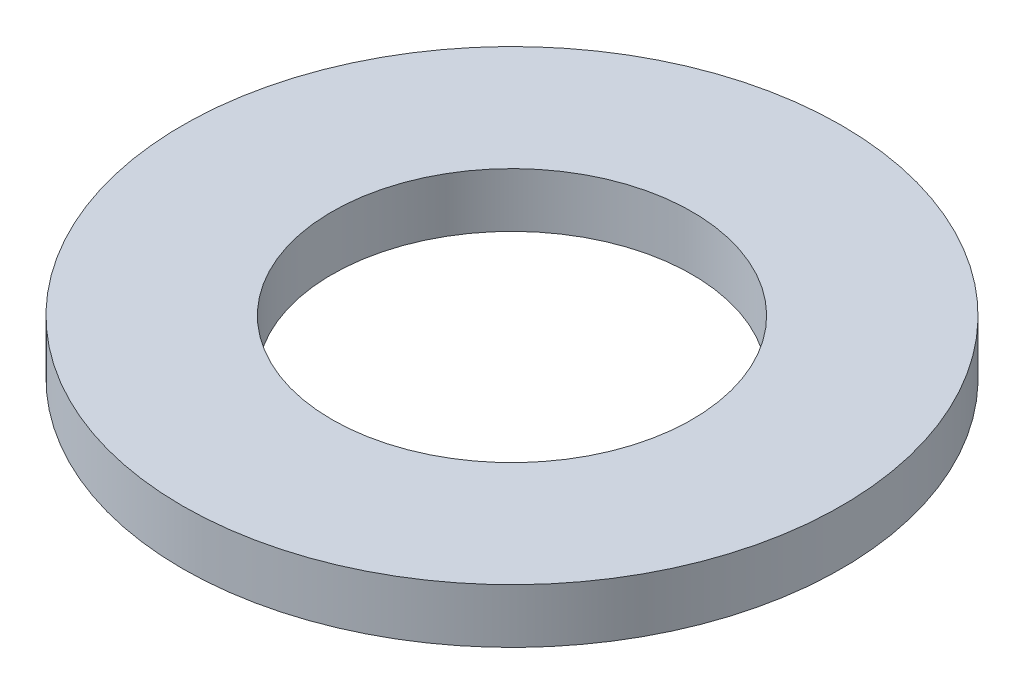
ISO-10303-21;
HEADER;
FILE_DESCRIPTION(('STEP AP214'),'2;1');
FILE_NAME('part.step','',(''),(''),'','','');
FILE_SCHEMA(('AUTOMOTIVE_DESIGN { 1 0 10303 214 1 1 1 1 }'));
ENDSEC;
DATA;
#1=APPLICATION_CONTEXT('core data for automotive mechanical design processes');
#2=APPLICATION_PROTOCOL_DEFINITION('international standard','automotive_design',2000,#1);
#3=PRODUCT_CONTEXT('',#1,'mechanical');
#4=PRODUCT('Part','Part','',(#3));
#5=PRODUCT_RELATED_PRODUCT_CATEGORY('part','',(#4));
#6=PRODUCT_DEFINITION_FORMATION('','',#4);
#7=PRODUCT_DEFINITION_CONTEXT('part definition',#1,'design');
#8=PRODUCT_DEFINITION('design','',#6,#7);
#9=PRODUCT_DEFINITION_SHAPE('','',#8);
#10=(LENGTH_UNIT() NAMED_UNIT(*) SI_UNIT(.MILLI.,.METRE.));
#11=(NAMED_UNIT(*) PLANE_ANGLE_UNIT() SI_UNIT($,.RADIAN.));
#12=(NAMED_UNIT(*) SI_UNIT($,.STERADIAN.) SOLID_ANGLE_UNIT());
#13=UNCERTAINTY_MEASURE_WITH_UNIT(LENGTH_MEASURE(1.E-05),#10,'distance_accuracy_value','');
#14=(GEOMETRIC_REPRESENTATION_CONTEXT(3) GLOBAL_UNCERTAINTY_ASSIGNED_CONTEXT((#13)) GLOBAL_UNIT_ASSIGNED_CONTEXT((#10,
#11,#12)) REPRESENTATION_CONTEXT('',''));
#15=CARTESIAN_POINT('',(0.,0.,0.));
#16=DIRECTION('',(0.,0.,1.));
#17=DIRECTION('',(1.,0.,0.));
#18=AXIS2_PLACEMENT_3D('',#15,#16,#17);
#19=CARTESIAN_POINT('',(0.,0.8,0.));
#20=DIRECTION('',(0.,1.,0.));
#21=DIRECTION('',(0.,0.,1.));
#22=AXIS2_PLACEMENT_3D('',#19,#20,#21);
#23=PLANE('',#22);
#24=CARTESIAN_POINT('',(0.,0.8,0.));
#25=DIRECTION('',(0.,1.,0.));
#26=DIRECTION('',(0.,0.,1.));
#27=AXIS2_PLACEMENT_3D('',#24,#25,#26);
#28=CIRCLE('',#27,4.85);
#29=CARTESIAN_POINT('',(0.,0.8,4.85));
#30=VERTEX_POINT('',#29);
#31=EDGE_CURVE('E10',#30,#30,#28,.T.);
#32=ORIENTED_EDGE('',*,*,#31,.T.);
#33=EDGE_LOOP('',(#32));
#34=FACE_BOUND('',#33,.T.);
#35=CARTESIAN_POINT('',(0.,0.8,0.));
#36=DIRECTION('',(0.,1.,0.));
#37=DIRECTION('',(0.,0.,1.));
#38=AXIS2_PLACEMENT_3D('',#35,#36,#37);
#39=CIRCLE('',#38,2.65);
#40=CARTESIAN_POINT('',(0.,0.8,2.65));
#41=VERTEX_POINT('',#40);
#42=EDGE_CURVE('E42',#41,#41,#39,.T.);
#43=ORIENTED_EDGE('',*,*,#42,.F.);
#44=EDGE_LOOP('',(#43));
#45=FACE_BOUND('',#44,.T.);
#46=ADVANCED_FACE('F31',(#34,#45),#23,.T.);
#47=CARTESIAN_POINT('',(0.,0.,0.));
#48=DIRECTION('',(0.,1.,0.));
#49=DIRECTION('',(0.,0.,1.));
#50=AXIS2_PLACEMENT_3D('',#47,#48,#49);
#51=PLANE('',#50);
#52=CARTESIAN_POINT('',(0.,0.,0.));
#53=DIRECTION('',(0.,1.,0.));
#54=DIRECTION('',(0.,0.,1.));
#55=AXIS2_PLACEMENT_3D('',#52,#53,#54);
#56=CIRCLE('',#55,4.85);
#57=CARTESIAN_POINT('',(0.,0.,4.85));
#58=VERTEX_POINT('',#57);
#59=EDGE_CURVE('E35',#58,#58,#56,.T.);
#60=ORIENTED_EDGE('',*,*,#59,.F.);
#61=EDGE_LOOP('',(#60));
#62=FACE_BOUND('',#61,.T.);
#63=CARTESIAN_POINT('',(0.,0.,0.));
#64=DIRECTION('',(0.,1.,0.));
#65=DIRECTION('',(0.,0.,1.));
#66=AXIS2_PLACEMENT_3D('',#63,#64,#65);
#67=CIRCLE('',#66,2.65);
#68=CARTESIAN_POINT('',(0.,0.,2.65));
#69=VERTEX_POINT('',#68);
#70=EDGE_CURVE('E44',#69,#69,#67,.T.);
#71=ORIENTED_EDGE('',*,*,#70,.T.);
#72=EDGE_LOOP('',(#71));
#73=FACE_BOUND('',#72,.T.);
#74=ADVANCED_FACE('F54',(#62,#73),#51,.F.);
#75=CARTESIAN_POINT('',(0.,0.8,0.));
#76=DIRECTION('',(0.,-1.,0.));
#77=DIRECTION('',(0.,0.,-1.));
#78=AXIS2_PLACEMENT_3D('',#75,#76,#77);
#79=CYLINDRICAL_SURFACE('',#78,4.85);
#80=ORIENTED_EDGE('',*,*,#31,.F.);
#81=EDGE_LOOP('',(#80));
#82=FACE_BOUND('',#81,.T.);
#83=ORIENTED_EDGE('',*,*,#59,.T.);
#84=EDGE_LOOP('',(#83));
#85=FACE_BOUND('',#84,.T.);
#86=ADVANCED_FACE('F33',(#82,#85),#79,.T.);
#87=CARTESIAN_POINT('',(0.,0.8,0.));
#88=DIRECTION('',(0.,-1.,0.));
#89=DIRECTION('',(0.,0.,-1.));
#90=AXIS2_PLACEMENT_3D('',#87,#88,#89);
#91=CYLINDRICAL_SURFACE('',#90,2.65);
#92=ORIENTED_EDGE('',*,*,#42,.T.);
#93=EDGE_LOOP('',(#92));
#94=FACE_BOUND('',#93,.T.);
#95=ORIENTED_EDGE('',*,*,#70,.F.);
#96=EDGE_LOOP('',(#95));
#97=FACE_BOUND('',#96,.T.);
#98=ADVANCED_FACE('F50',(#94,#97),#91,.F.);
#99=CLOSED_SHELL('',(#46,#74,#86,#98));
#100=MANIFOLD_SOLID_BREP('B2',#99);
#101=ADVANCED_BREP_SHAPE_REPRESENTATION('',(#18,#100),#14);
#102=SHAPE_DEFINITION_REPRESENTATION(#9,#101);
ENDSEC;
END-ISO-10303-21;
